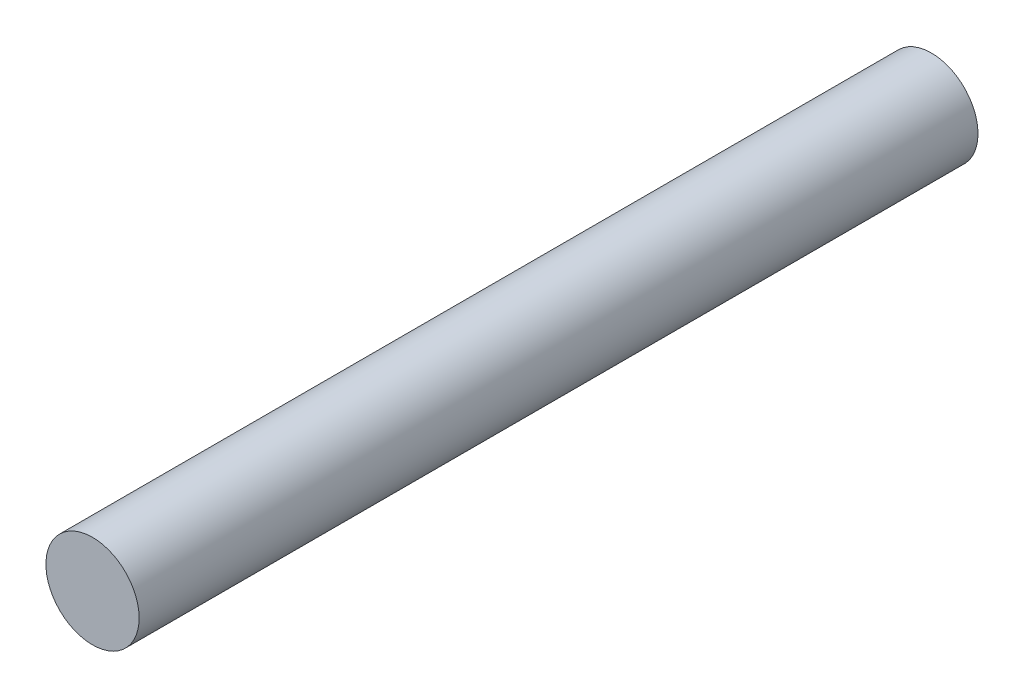
ISO-10303-21;
HEADER;
FILE_DESCRIPTION(('STEP AP214'),'2;1');
FILE_NAME('part.step','',(''),(''),'','','');
FILE_SCHEMA(('AUTOMOTIVE_DESIGN { 1 0 10303 214 1 1 1 1 }'));
ENDSEC;
DATA;
#1=APPLICATION_CONTEXT('core data for automotive mechanical design processes');
#2=APPLICATION_PROTOCOL_DEFINITION('international standard','automotive_design',2000,#1);
#3=PRODUCT_CONTEXT('',#1,'mechanical');
#4=PRODUCT('Part','Part','',(#3));
#5=PRODUCT_RELATED_PRODUCT_CATEGORY('part','',(#4));
#6=PRODUCT_DEFINITION_FORMATION('','',#4);
#7=PRODUCT_DEFINITION_CONTEXT('part definition',#1,'design');
#8=PRODUCT_DEFINITION('design','',#6,#7);
#9=PRODUCT_DEFINITION_SHAPE('','',#8);
#10=(LENGTH_UNIT() NAMED_UNIT(*) SI_UNIT(.MILLI.,.METRE.));
#11=(NAMED_UNIT(*) PLANE_ANGLE_UNIT() SI_UNIT($,.RADIAN.));
#12=(NAMED_UNIT(*) SI_UNIT($,.STERADIAN.) SOLID_ANGLE_UNIT());
#13=UNCERTAINTY_MEASURE_WITH_UNIT(LENGTH_MEASURE(1.E-05),#10,'distance_accuracy_value','');
#14=(GEOMETRIC_REPRESENTATION_CONTEXT(3) GLOBAL_UNCERTAINTY_ASSIGNED_CONTEXT((#13)) GLOBAL_UNIT_ASSIGNED_CONTEXT((#10,
#11,#12)) REPRESENTATION_CONTEXT('',''));
#15=CARTESIAN_POINT('',(0.,0.,0.));
#16=DIRECTION('',(0.,0.,1.));
#17=DIRECTION('',(1.,0.,0.));
#18=AXIS2_PLACEMENT_3D('',#15,#16,#17);
#19=CARTESIAN_POINT('',(0.,0.,14.2875));
#20=DIRECTION('',(0.,0.,-1.));
#21=DIRECTION('',(-1.,0.,0.));
#22=AXIS2_PLACEMENT_3D('',#19,#20,#21);
#23=CYLINDRICAL_SURFACE('',#22,1.5875);
#24=CARTESIAN_POINT('',(0.,0.,14.2875));
#25=DIRECTION('',(0.,0.,1.));
#26=DIRECTION('',(1.,0.,0.));
#27=AXIS2_PLACEMENT_3D('',#24,#25,#26);
#28=CIRCLE('',#27,1.5875);
#29=CARTESIAN_POINT('',(1.5875,0.,14.2875));
#30=VERTEX_POINT('',#29);
#31=EDGE_CURVE('E10',#30,#30,#28,.T.);
#32=ORIENTED_EDGE('',*,*,#31,.F.);
#33=EDGE_LOOP('',(#32));
#34=FACE_BOUND('',#33,.T.);
#35=CARTESIAN_POINT('',(0.,0.,-14.2875));
#36=DIRECTION('',(0.,0.,1.));
#37=DIRECTION('',(1.,0.,0.));
#38=AXIS2_PLACEMENT_3D('',#35,#36,#37);
#39=CIRCLE('',#38,1.5875);
#40=CARTESIAN_POINT('',(1.5875,0.,-14.2875));
#41=VERTEX_POINT('',#40);
#42=EDGE_CURVE('E34',#41,#41,#39,.T.);
#43=ORIENTED_EDGE('',*,*,#42,.T.);
#44=EDGE_LOOP('',(#43));
#45=FACE_BOUND('',#44,.T.);
#46=ADVANCED_FACE('F31',(#34,#45),#23,.T.);
#47=CARTESIAN_POINT('',(0.,0.,14.2875));
#48=DIRECTION('',(0.,0.,1.));
#49=DIRECTION('',(1.,0.,0.));
#50=AXIS2_PLACEMENT_3D('',#47,#48,#49);
#51=PLANE('',#50);
#52=ORIENTED_EDGE('',*,*,#31,.T.);
#53=EDGE_LOOP('',(#52));
#54=FACE_BOUND('',#53,.T.);
#55=ADVANCED_FACE('F46',(#54),#51,.T.);
#56=CARTESIAN_POINT('',(0.,0.,-14.2875));
#57=DIRECTION('',(0.,0.,1.));
#58=DIRECTION('',(1.,0.,0.));
#59=AXIS2_PLACEMENT_3D('',#56,#57,#58);
#60=PLANE('',#59);
#61=ORIENTED_EDGE('',*,*,#42,.F.);
#62=EDGE_LOOP('',(#61));
#63=FACE_BOUND('',#62,.T.);
#64=ADVANCED_FACE('F44',(#63),#60,.F.);
#65=CLOSED_SHELL('',(#46,#55,#64));
#66=MANIFOLD_SOLID_BREP('B2',#65);
#67=ADVANCED_BREP_SHAPE_REPRESENTATION('',(#18,#66),#14);
#68=SHAPE_DEFINITION_REPRESENTATION(#9,#67);
ENDSEC;
END-ISO-10303-21;
